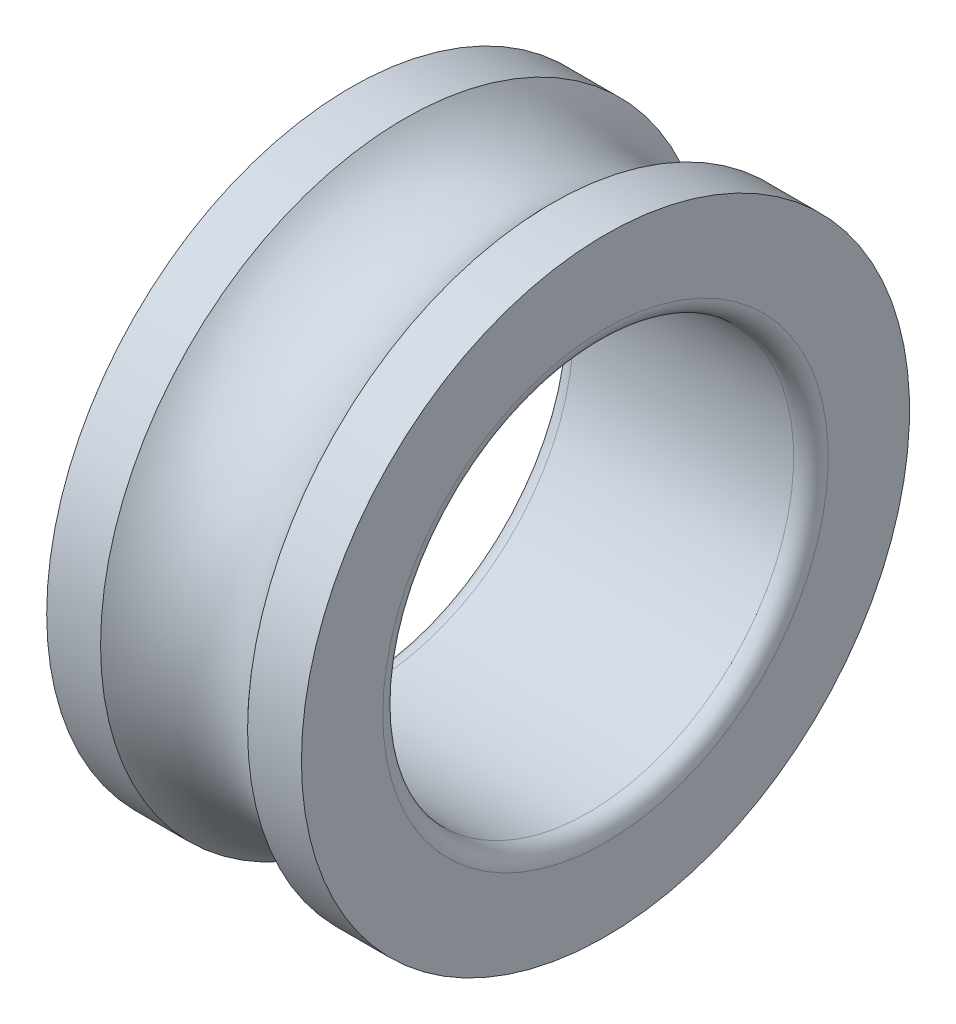
ISO-10303-21;
HEADER;
FILE_DESCRIPTION(('STEP AP214'),'2;1');
FILE_NAME('part.step','',(''),(''),'','','');
FILE_SCHEMA(('AUTOMOTIVE_DESIGN { 1 0 10303 214 1 1 1 1 }'));
ENDSEC;
DATA;
#1=APPLICATION_CONTEXT('core data for automotive mechanical design processes');
#2=APPLICATION_PROTOCOL_DEFINITION('international standard','automotive_design',2000,#1);
#3=PRODUCT_CONTEXT('',#1,'mechanical');
#4=PRODUCT('Part','Part','',(#3));
#5=PRODUCT_RELATED_PRODUCT_CATEGORY('part','',(#4));
#6=PRODUCT_DEFINITION_FORMATION('','',#4);
#7=PRODUCT_DEFINITION_CONTEXT('part definition',#1,'design');
#8=PRODUCT_DEFINITION('design','',#6,#7);
#9=PRODUCT_DEFINITION_SHAPE('','',#8);
#10=(LENGTH_UNIT() NAMED_UNIT(*) SI_UNIT(.MILLI.,.METRE.));
#11=(NAMED_UNIT(*) PLANE_ANGLE_UNIT() SI_UNIT($,.RADIAN.));
#12=(NAMED_UNIT(*) SI_UNIT($,.STERADIAN.) SOLID_ANGLE_UNIT());
#13=UNCERTAINTY_MEASURE_WITH_UNIT(LENGTH_MEASURE(1.E-05),#10,'distance_accuracy_value','');
#14=(GEOMETRIC_REPRESENTATION_CONTEXT(3) GLOBAL_UNCERTAINTY_ASSIGNED_CONTEXT((#13)) GLOBAL_UNIT_ASSIGNED_CONTEXT((#10,
#11,#12)) REPRESENTATION_CONTEXT('',''));
#15=CARTESIAN_POINT('',(0.,0.,0.));
#16=DIRECTION('',(0.,0.,1.));
#17=DIRECTION('',(1.,0.,0.));
#18=AXIS2_PLACEMENT_3D('',#15,#16,#17);
#19=CARTESIAN_POINT('',(15.5,37.,0.));
#20=DIRECTION('',(-1.,0.,0.));
#21=DIRECTION('',(0.,0.,1.));
#22=AXIS2_PLACEMENT_3D('',#19,#20,#21);
#23=PLANE('',#22);
#24=CARTESIAN_POINT('',(15.5,0.,0.));
#25=DIRECTION('',(-1.,0.,0.));
#26=DIRECTION('',(0.,0.,1.));
#27=AXIS2_PLACEMENT_3D('',#24,#25,#26);
#28=CIRCLE('',#27,27.1);
#29=CARTESIAN_POINT('',(15.5,0.,27.1));
#30=VERTEX_POINT('',#29);
#31=EDGE_CURVE('E10',#30,#30,#28,.T.);
#32=ORIENTED_EDGE('',*,*,#31,.T.);
#33=EDGE_LOOP('',(#32));
#34=FACE_BOUND('',#33,.T.);
#35=CARTESIAN_POINT('',(15.5,0.,0.));
#36=DIRECTION('',(-1.,0.,0.));
#37=DIRECTION('',(0.,0.,1.));
#38=AXIS2_PLACEMENT_3D('',#35,#36,#37);
#39=CIRCLE('',#38,37.);
#40=CARTESIAN_POINT('',(15.5,0.,37.));
#41=VERTEX_POINT('',#40);
#42=EDGE_CURVE('E61',#41,#41,#39,.T.);
#43=ORIENTED_EDGE('',*,*,#42,.F.);
#44=EDGE_LOOP('',(#43));
#45=FACE_BOUND('',#44,.T.);
#46=ADVANCED_FACE('F37',(#34,#45),#23,.F.);
#47=CARTESIAN_POINT('',(0.,0.,0.));
#48=DIRECTION('',(-1.,0.,0.));
#49=DIRECTION('',(0.,0.,1.));
#50=AXIS2_PLACEMENT_3D('',#47,#48,#49);
#51=CYLINDRICAL_SURFACE('',#50,37.);
#52=CARTESIAN_POINT('',(8.94427190999915,0.,0.));
#53=DIRECTION('',(-1.,0.,0.));
#54=DIRECTION('',(0.,0.,1.));
#55=AXIS2_PLACEMENT_3D('',#52,#53,#54);
#56=CIRCLE('',#55,37.);
#57=CARTESIAN_POINT('',(8.94427190999915,0.,37.));
#58=VERTEX_POINT('',#57);
#59=EDGE_CURVE('E65',#58,#58,#56,.T.);
#60=ORIENTED_EDGE('',*,*,#59,.F.);
#61=EDGE_LOOP('',(#60));
#62=FACE_BOUND('',#61,.T.);
#63=ORIENTED_EDGE('',*,*,#42,.T.);
#64=EDGE_LOOP('',(#63));
#65=FACE_BOUND('',#64,.T.);
#66=ADVANCED_FACE('F89',(#62,#65),#51,.T.);
#67=CARTESIAN_POINT('',(0.,0.,0.));
#68=DIRECTION('',(-1.,0.,0.));
#69=DIRECTION('',(0.,0.,1.));
#70=AXIS2_PLACEMENT_3D('',#67,#68,#69);
#71=TOROIDAL_SURFACE('',#70,45.,12.);
#72=CARTESIAN_POINT('',(-8.94427190999916,0.,0.));
#73=DIRECTION('',(-1.,0.,0.));
#74=DIRECTION('',(0.,0.,1.));
#75=AXIS2_PLACEMENT_3D('',#72,#73,#74);
#76=CIRCLE('',#75,37.);
#77=CARTESIAN_POINT('',(-8.94427190999916,0.,37.));
#78=VERTEX_POINT('',#77);
#79=EDGE_CURVE('E69',#78,#78,#76,.T.);
#80=ORIENTED_EDGE('',*,*,#79,.F.);
#81=EDGE_LOOP('',(#80));
#82=FACE_BOUND('',#81,.T.);
#83=ORIENTED_EDGE('',*,*,#59,.T.);
#84=EDGE_LOOP('',(#83));
#85=FACE_BOUND('',#84,.T.);
#86=ADVANCED_FACE('F83',(#82,#85),#71,.F.);
#87=CARTESIAN_POINT('',(0.,0.,0.));
#88=DIRECTION('',(-1.,0.,0.));
#89=DIRECTION('',(0.,0.,1.));
#90=AXIS2_PLACEMENT_3D('',#87,#88,#89);
#91=CYLINDRICAL_SURFACE('',#90,37.);
#92=CARTESIAN_POINT('',(-15.5,0.,0.));
#93=DIRECTION('',(-1.,0.,0.));
#94=DIRECTION('',(0.,0.,1.));
#95=AXIS2_PLACEMENT_3D('',#92,#93,#94);
#96=CIRCLE('',#95,37.);
#97=CARTESIAN_POINT('',(-15.5,0.,37.));
#98=VERTEX_POINT('',#97);
#99=EDGE_CURVE('E73',#98,#98,#96,.T.);
#100=ORIENTED_EDGE('',*,*,#99,.F.);
#101=EDGE_LOOP('',(#100));
#102=FACE_BOUND('',#101,.T.);
#103=ORIENTED_EDGE('',*,*,#79,.T.);
#104=EDGE_LOOP('',(#103));
#105=FACE_BOUND('',#104,.T.);
#106=ADVANCED_FACE('F80',(#102,#105),#91,.T.);
#107=CARTESIAN_POINT('',(-15.5,37.,0.));
#108=DIRECTION('',(1.,0.,0.));
#109=DIRECTION('',(0.,0.,-1.));
#110=AXIS2_PLACEMENT_3D('',#107,#108,#109);
#111=PLANE('',#110);
#112=CARTESIAN_POINT('',(-15.5,0.,0.));
#113=DIRECTION('',(1.,0.,0.));
#114=DIRECTION('',(0.,0.,-1.));
#115=AXIS2_PLACEMENT_3D('',#112,#113,#114);
#116=CIRCLE('',#115,27.1);
#117=CARTESIAN_POINT('',(-15.5,0.,-27.1));
#118=VERTEX_POINT('',#117);
#119=EDGE_CURVE('E45',#118,#118,#116,.T.);
#120=ORIENTED_EDGE('',*,*,#119,.T.);
#121=EDGE_LOOP('',(#120));
#122=FACE_BOUND('',#121,.T.);
#123=ORIENTED_EDGE('',*,*,#99,.T.);
#124=EDGE_LOOP('',(#123));
#125=FACE_BOUND('',#124,.T.);
#126=ADVANCED_FACE('F78',(#122,#125),#111,.F.);
#127=CARTESIAN_POINT('',(0.,0.,0.));
#128=DIRECTION('',(-1.,0.,0.));
#129=DIRECTION('',(0.,0.,1.));
#130=AXIS2_PLACEMENT_3D('',#127,#128,#129);
#131=CYLINDRICAL_SURFACE('',#130,25.);
#132=CARTESIAN_POINT('',(-13.4,0.,0.));
#133=DIRECTION('',(1.,0.,0.));
#134=DIRECTION('',(0.,0.,-1.));
#135=AXIS2_PLACEMENT_3D('',#132,#133,#134);
#136=CIRCLE('',#135,25.);
#137=CARTESIAN_POINT('',(-13.4,0.,-25.));
#138=VERTEX_POINT('',#137);
#139=EDGE_CURVE('E50',#138,#138,#136,.F.);
#140=ORIENTED_EDGE('',*,*,#139,.T.);
#141=EDGE_LOOP('',(#140));
#142=FACE_BOUND('',#141,.T.);
#143=CARTESIAN_POINT('',(13.4,0.,0.));
#144=DIRECTION('',(-1.,0.,0.));
#145=DIRECTION('',(0.,0.,1.));
#146=AXIS2_PLACEMENT_3D('',#143,#144,#145);
#147=CIRCLE('',#146,25.);
#148=CARTESIAN_POINT('',(13.4,0.,25.));
#149=VERTEX_POINT('',#148);
#150=EDGE_CURVE('E55',#149,#149,#147,.F.);
#151=ORIENTED_EDGE('',*,*,#150,.T.);
#152=EDGE_LOOP('',(#151));
#153=FACE_BOUND('',#152,.T.);
#154=ADVANCED_FACE('F104',(#142,#153),#131,.F.);
#155=CARTESIAN_POINT('',(-13.4,0.,0.));
#156=DIRECTION('',(1.,0.,0.));
#157=DIRECTION('',(0.,0.,-1.));
#158=AXIS2_PLACEMENT_3D('',#155,#156,#157);
#159=TOROIDAL_SURFACE('',#158,27.1,2.1);
#160=ORIENTED_EDGE('',*,*,#119,.F.);
#161=EDGE_LOOP('',(#160));
#162=FACE_BOUND('',#161,.T.);
#163=ORIENTED_EDGE('',*,*,#139,.F.);
#164=EDGE_LOOP('',(#163));
#165=FACE_BOUND('',#164,.T.);
#166=ADVANCED_FACE('F102',(#162,#165),#159,.T.);
#167=CARTESIAN_POINT('',(13.4,0.,0.));
#168=DIRECTION('',(-1.,0.,0.));
#169=DIRECTION('',(0.,0.,1.));
#170=AXIS2_PLACEMENT_3D('',#167,#168,#169);
#171=TOROIDAL_SURFACE('',#170,27.1,2.1);
#172=ORIENTED_EDGE('',*,*,#150,.F.);
#173=EDGE_LOOP('',(#172));
#174=FACE_BOUND('',#173,.T.);
#175=ORIENTED_EDGE('',*,*,#31,.F.);
#176=EDGE_LOOP('',(#175));
#177=FACE_BOUND('',#176,.T.);
#178=ADVANCED_FACE('F39',(#174,#177),#171,.T.);
#179=CLOSED_SHELL('',(#46,#66,#86,#106,#126,#154,#166,#178));
#180=MANIFOLD_SOLID_BREP('B2',#179);
#181=ADVANCED_BREP_SHAPE_REPRESENTATION('',(#18,#180),#14);
#182=SHAPE_DEFINITION_REPRESENTATION(#9,#181);
ENDSEC;
END-ISO-10303-21;
